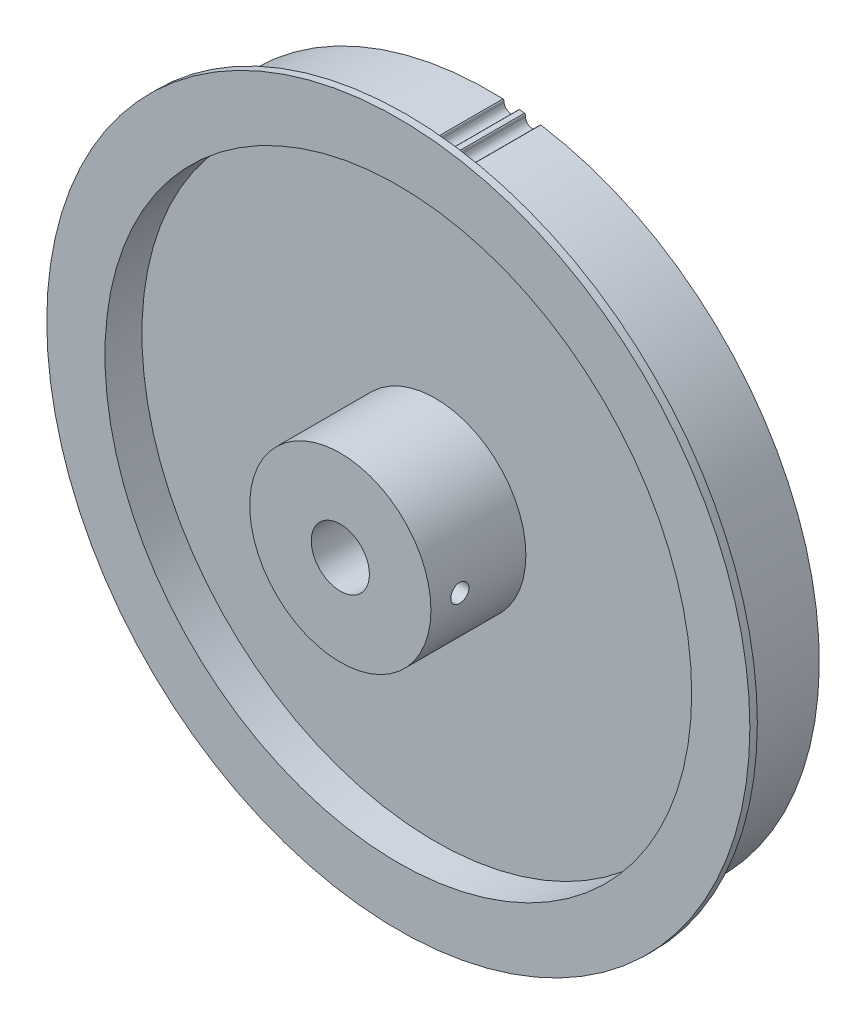
ISO-10303-21;
HEADER;
FILE_DESCRIPTION(('STEP AP214'),'2;1');
FILE_NAME('part.step','',(''),(''),'','','');
FILE_SCHEMA(('AUTOMOTIVE_DESIGN { 1 0 10303 214 1 1 1 1 }'));
ENDSEC;
DATA;
#1=APPLICATION_CONTEXT('core data for automotive mechanical design processes');
#2=APPLICATION_PROTOCOL_DEFINITION('international standard','automotive_design',2000,#1);
#3=PRODUCT_CONTEXT('',#1,'mechanical');
#4=PRODUCT('Part','Part','',(#3));
#5=PRODUCT_RELATED_PRODUCT_CATEGORY('part','',(#4));
#6=PRODUCT_DEFINITION_FORMATION('','',#4);
#7=PRODUCT_DEFINITION_CONTEXT('part definition',#1,'design');
#8=PRODUCT_DEFINITION('design','',#6,#7);
#9=PRODUCT_DEFINITION_SHAPE('','',#8);
#10=(LENGTH_UNIT() NAMED_UNIT(*) SI_UNIT(.MILLI.,.METRE.));
#11=(NAMED_UNIT(*) PLANE_ANGLE_UNIT() SI_UNIT($,.RADIAN.));
#12=(NAMED_UNIT(*) SI_UNIT($,.STERADIAN.) SOLID_ANGLE_UNIT());
#13=UNCERTAINTY_MEASURE_WITH_UNIT(LENGTH_MEASURE(1.E-05),#10,'distance_accuracy_value','');
#14=(GEOMETRIC_REPRESENTATION_CONTEXT(3) GLOBAL_UNCERTAINTY_ASSIGNED_CONTEXT((#13)) GLOBAL_UNIT_ASSIGNED_CONTEXT((#10,
#11,#12)) REPRESENTATION_CONTEXT('',''));
#15=CARTESIAN_POINT('',(0.,0.,0.));
#16=DIRECTION('',(0.,0.,1.));
#17=DIRECTION('',(1.,0.,0.));
#18=AXIS2_PLACEMENT_3D('',#15,#16,#17);
#19=CARTESIAN_POINT('',(-6.468849377307,44.12556718408,5.55));
#20=DIRECTION('',(0.,0.,1.));
#21=DIRECTION('',(1.,0.,0.));
#22=AXIS2_PLACEMENT_3D('',#19,#20,#21);
#23=CYLINDRICAL_SURFACE('',#22,11.43);
#24=DIRECTION('',(0.,0.,1.));
#25=VECTOR('',#24,1.);
#26=CARTESIAN_POINT('',(4.94000741896315,44.82046761019,5.55));
#27=LINE('',#26,#25);
#28=CARTESIAN_POINT('',(4.94000741896301,44.8204676101896,5.55));
#29=VERTEX_POINT('',#28);
#30=CARTESIAN_POINT('',(4.94000741896301,44.8204676101896,-5.5));
#31=VERTEX_POINT('',#30);
#32=EDGE_CURVE('E104',#29,#31,#27,.F.);
#33=ORIENTED_EDGE('',*,*,#32,.T.);
#34=CARTESIAN_POINT('',(-6.468849377307,44.12556718408,-5.5));
#35=DIRECTION('',(0.,0.,1.));
#36=DIRECTION('',(1.,0.,0.));
#37=AXIS2_PLACEMENT_3D('',#34,#35,#36);
#38=CIRCLE('',#37,11.43);
#39=CARTESIAN_POINT('',(4.92698409902675,45.0086749802588,-5.5));
#40=VERTEX_POINT('',#39);
#41=EDGE_CURVE('E109',#31,#40,#38,.T.);
#42=ORIENTED_EDGE('',*,*,#41,.T.);
#43=DIRECTION('',(0.,0.,1.));
#44=VECTOR('',#43,1.);
#45=CARTESIAN_POINT('',(4.92698409902668,45.00867498026,5.55));
#46=LINE('',#45,#44);
#47=CARTESIAN_POINT('',(4.92698409902675,45.0086749802588,5.55));
#48=VERTEX_POINT('',#47);
#49=EDGE_CURVE('E107',#48,#40,#46,.F.);
#50=ORIENTED_EDGE('',*,*,#49,.F.);
#51=CARTESIAN_POINT('',(-6.468849377307,44.12556718408,5.55));
#52=DIRECTION('',(0.,0.,1.));
#53=DIRECTION('',(1.,0.,0.));
#54=AXIS2_PLACEMENT_3D('',#51,#52,#53);
#55=CIRCLE('',#54,11.43);
#56=EDGE_CURVE('E19',#48,#29,#55,.F.);
#57=ORIENTED_EDGE('',*,*,#56,.T.);
#58=EDGE_LOOP('',(#33,#42,#50,#57));
#59=FACE_BOUND('',#58,.T.);
#60=ADVANCED_FACE('F16',(#59),#23,.T.);
#61=CARTESIAN_POINT('',(14.95302336149,42.0156968755,5.55));
#62=DIRECTION('',(0.,0.,1.));
#63=DIRECTION('',(1.,0.,0.));
#64=AXIS2_PLACEMENT_3D('',#61,#62,#63);
#65=CYLINDRICAL_SURFACE('',#64,11.43);
#66=DIRECTION('',(0.,0.,1.));
#67=VECTOR('',#66,1.);
#68=CARTESIAN_POINT('',(3.94844341431126,45.1050528255402,5.55));
#69=LINE('',#68,#67);
#70=CARTESIAN_POINT('',(3.94844341430986,45.1050528255435,-5.5));
#71=VERTEX_POINT('',#70);
#72=CARTESIAN_POINT('',(3.94844341430986,45.1050528255435,5.55));
#73=VERTEX_POINT('',#72);
#74=EDGE_CURVE('E141',#71,#73,#69,.T.);
#75=ORIENTED_EDGE('',*,*,#74,.F.);
#76=CARTESIAN_POINT('',(14.95302336149,42.0156968755,-5.5));
#77=DIRECTION('',(0.,0.,1.));
#78=DIRECTION('',(1.,0.,0.));
#79=AXIS2_PLACEMENT_3D('',#76,#77,#78);
#80=CIRCLE('',#79,11.43);
#81=CARTESIAN_POINT('',(3.89895289738062,44.9230025309883,-5.5));
#82=VERTEX_POINT('',#81);
#83=EDGE_CURVE('E147',#71,#82,#80,.T.);
#84=ORIENTED_EDGE('',*,*,#83,.T.);
#85=DIRECTION('',(0.,0.,1.));
#86=VECTOR('',#85,1.);
#87=CARTESIAN_POINT('',(3.89895289738418,44.9230025309897,5.55));
#88=LINE('',#87,#86);
#89=CARTESIAN_POINT('',(3.89895289738062,44.9230025309883,5.55));
#90=VERTEX_POINT('',#89);
#91=EDGE_CURVE('E117',#82,#90,#88,.T.);
#92=ORIENTED_EDGE('',*,*,#91,.T.);
#93=CARTESIAN_POINT('',(14.95302336149,42.0156968755,5.55));
#94=DIRECTION('',(0.,0.,1.));
#95=DIRECTION('',(1.,0.,0.));
#96=AXIS2_PLACEMENT_3D('',#93,#94,#95);
#97=CIRCLE('',#96,11.43);
#98=EDGE_CURVE('E149',#90,#73,#97,.F.);
#99=ORIENTED_EDGE('',*,*,#98,.T.);
#100=EDGE_LOOP('',(#75,#84,#92,#99));
#101=FACE_BOUND('',#100,.T.);
#102=ADVANCED_FACE('F348',(#101),#65,.T.);
#103=CARTESIAN_POINT('',(-9.340949247126,43.6080079658,5.55));
#104=DIRECTION('',(0.,0.,1.));
#105=DIRECTION('',(1.,0.,0.));
#106=AXIS2_PLACEMENT_3D('',#103,#104,#105);
#107=CYLINDRICAL_SURFACE('',#106,11.43);
#108=DIRECTION('',(0.,0.,1.));
#109=VECTOR('',#108,1.);
#110=CARTESIAN_POINT('',(1.99803164861319,45.04759549217,5.55));
#111=LINE('',#110,#109);
#112=CARTESIAN_POINT('',(1.9980316486129,45.0475954921691,5.55));
#113=VERTEX_POINT('',#112);
#114=CARTESIAN_POINT('',(1.9980316486129,45.0475954921691,-5.5));
#115=VERTEX_POINT('',#114);
#116=EDGE_CURVE('E157',#113,#115,#111,.F.);
#117=ORIENTED_EDGE('',*,*,#116,.T.);
#118=CARTESIAN_POINT('',(-9.340949247126,43.6080079658,-5.5));
#119=DIRECTION('',(0.,0.,1.));
#120=DIRECTION('',(1.,0.,0.));
#121=AXIS2_PLACEMENT_3D('',#118,#119,#120);
#122=CIRCLE('',#121,11.43);
#123=CARTESIAN_POINT('',(1.97272686165669,45.2345481299438,-5.5));
#124=VERTEX_POINT('',#123);
#125=EDGE_CURVE('E145',#115,#124,#122,.T.);
#126=ORIENTED_EDGE('',*,*,#125,.T.);
#127=DIRECTION('',(0.,0.,1.));
#128=VECTOR('',#127,1.);
#129=CARTESIAN_POINT('',(1.9727268616578,45.2345481299401,5.55));
#130=LINE('',#129,#128);
#131=CARTESIAN_POINT('',(1.97272686165669,45.2345481299438,5.55));
#132=VERTEX_POINT('',#131);
#133=EDGE_CURVE('E133',#132,#124,#130,.F.);
#134=ORIENTED_EDGE('',*,*,#133,.F.);
#135=CARTESIAN_POINT('',(-9.340949247126,43.6080079658,5.55));
#136=DIRECTION('',(0.,0.,1.));
#137=DIRECTION('',(1.,0.,0.));
#138=AXIS2_PLACEMENT_3D('',#135,#136,#137);
#139=CIRCLE('',#138,11.43);
#140=EDGE_CURVE('E139',#132,#113,#139,.F.);
#141=ORIENTED_EDGE('',*,*,#140,.T.);
#142=EDGE_LOOP('',(#117,#126,#134,#141));
#143=FACE_BOUND('',#142,.T.);
#144=ADVANCED_FACE('F345',(#143),#107,.T.);
#145=CARTESIAN_POINT('',(17.66896584311,40.94776352401,5.55));
#146=DIRECTION('',(0.,0.,1.));
#147=DIRECTION('',(1.,0.,0.));
#148=AXIS2_PLACEMENT_3D('',#145,#146,#147);
#149=CYLINDRICAL_SURFACE('',#148,11.43);
#150=DIRECTION('',(0.,0.,1.));
#151=VECTOR('',#150,1.);
#152=CARTESIAN_POINT('',(6.89000109275661,44.7502388902298,5.55));
#153=LINE('',#152,#151);
#154=CARTESIAN_POINT('',(6.89000109275763,44.7502388902281,-5.5));
#155=VERTEX_POINT('',#154);
#156=CARTESIAN_POINT('',(6.89000109275763,44.7502388902281,5.55));
#157=VERTEX_POINT('',#156);
#158=EDGE_CURVE('E126',#155,#157,#153,.T.);
#159=ORIENTED_EDGE('',*,*,#158,.F.);
#160=CARTESIAN_POINT('',(17.66896584311,40.94776352401,-5.5));
#161=DIRECTION('',(0.,0.,1.));
#162=DIRECTION('',(1.,0.,0.));
#163=AXIS2_PLACEMENT_3D('',#160,#161,#162);
#164=CIRCLE('',#163,11.43);
#165=CARTESIAN_POINT('',(6.82870987988299,44.5718152140093,-5.5));
#166=VERTEX_POINT('',#165);
#167=EDGE_CURVE('E142',#155,#166,#164,.T.);
#168=ORIENTED_EDGE('',*,*,#167,.T.);
#169=DIRECTION('',(0.,0.,1.));
#170=VECTOR('',#169,1.);
#171=CARTESIAN_POINT('',(6.8287098798803,44.5718152140102,5.55));
#172=LINE('',#171,#170);
#173=CARTESIAN_POINT('',(6.82870987988299,44.5718152140093,5.55));
#174=VERTEX_POINT('',#173);
#175=EDGE_CURVE('E118',#166,#174,#172,.T.);
#176=ORIENTED_EDGE('',*,*,#175,.T.);
#177=CARTESIAN_POINT('',(17.66896584311,40.94776352401,5.55));
#178=DIRECTION('',(0.,0.,1.));
#179=DIRECTION('',(1.,0.,0.));
#180=AXIS2_PLACEMENT_3D('',#177,#178,#179);
#181=CIRCLE('',#180,11.43);
#182=EDGE_CURVE('E121',#174,#157,#181,.F.);
#183=ORIENTED_EDGE('',*,*,#182,.T.);
#184=EDGE_LOOP('',(#159,#168,#176,#183));
#185=FACE_BOUND('',#184,.T.);
#186=ADVANCED_FACE('F342',(#185),#149,.T.);
#187=CARTESIAN_POINT('',(5.908492595891,44.87945693525,5.55));
#188=DIRECTION('',(0.,0.,1.));
#189=DIRECTION('',(1.,0.,0.));
#190=AXIS2_PLACEMENT_3D('',#187,#188,#189);
#191=CYLINDRICAL_SURFACE('',#190,0.97028);
#192=CARTESIAN_POINT('',(5.908492595891,44.87945693525,5.55));
#193=DIRECTION('',(0.,0.,1.));
#194=DIRECTION('',(1.,0.,0.));
#195=AXIS2_PLACEMENT_3D('',#192,#193,#194);
#196=CIRCLE('',#195,0.97028);
#197=EDGE_CURVE('E114',#29,#174,#196,.T.);
#198=ORIENTED_EDGE('',*,*,#197,.T.);
#199=ORIENTED_EDGE('',*,*,#175,.F.);
#200=CARTESIAN_POINT('',(5.908492595891,44.87945693525,-5.5));
#201=DIRECTION('',(0.,0.,1.));
#202=DIRECTION('',(1.,0.,0.));
#203=AXIS2_PLACEMENT_3D('',#200,#201,#202);
#204=CIRCLE('',#203,0.97028);
#205=EDGE_CURVE('E116',#166,#31,#204,.F.);
#206=ORIENTED_EDGE('',*,*,#205,.T.);
#207=ORIENTED_EDGE('',*,*,#32,.F.);
#208=EDGE_LOOP('',(#198,#199,#206,#207));
#209=FACE_BOUND('',#208,.T.);
#210=ADVANCED_FACE('F112',(#209),#191,.F.);
#211=CARTESIAN_POINT('',(2.960585137985,45.16980047774,5.55));
#212=DIRECTION('',(0.,0.,1.));
#213=DIRECTION('',(1.,0.,0.));
#214=AXIS2_PLACEMENT_3D('',#211,#212,#213);
#215=CYLINDRICAL_SURFACE('',#214,0.97028);
#216=CARTESIAN_POINT('',(2.960585137985,45.16980047774,5.55));
#217=DIRECTION('',(0.,0.,1.));
#218=DIRECTION('',(1.,0.,0.));
#219=AXIS2_PLACEMENT_3D('',#216,#217,#218);
#220=CIRCLE('',#219,0.97028);
#221=EDGE_CURVE('E136',#113,#90,#220,.T.);
#222=ORIENTED_EDGE('',*,*,#221,.T.);
#223=ORIENTED_EDGE('',*,*,#91,.F.);
#224=CARTESIAN_POINT('',(2.960585137985,45.16980047774,-5.5));
#225=DIRECTION('',(0.,0.,1.));
#226=DIRECTION('',(1.,0.,0.));
#227=AXIS2_PLACEMENT_3D('',#224,#225,#226);
#228=CIRCLE('',#227,0.97028);
#229=EDGE_CURVE('E168',#82,#115,#228,.F.);
#230=ORIENTED_EDGE('',*,*,#229,.T.);
#231=ORIENTED_EDGE('',*,*,#116,.F.);
#232=EDGE_LOOP('',(#222,#223,#230,#231));
#233=FACE_BOUND('',#232,.T.);
#234=ADVANCED_FACE('F335',(#233),#215,.F.);
#235=CARTESIAN_POINT('',(0.,0.,-6.13));
#236=DIRECTION('',(0.,0.,1.));
#237=DIRECTION('',(1.,0.,0.));
#238=AXIS2_PLACEMENT_3D('',#235,#236,#237);
#239=CYLINDRICAL_SURFACE('',#238,40.475);
#240=CARTESIAN_POINT('',(0.,0.,-2.));
#241=DIRECTION('',(0.,0.,1.));
#242=DIRECTION('',(1.,0.,0.));
#243=AXIS2_PLACEMENT_3D('',#240,#241,#242);
#244=CIRCLE('',#243,40.475);
#245=CARTESIAN_POINT('',(40.475,0.,-2.));
#246=VERTEX_POINT('',#245);
#247=EDGE_CURVE('E182',#246,#246,#244,.T.);
#248=ORIENTED_EDGE('',*,*,#247,.T.);
#249=EDGE_LOOP('',(#248));
#250=FACE_BOUND('',#249,.T.);
#251=CARTESIAN_POINT('',(0.,0.,-5.5));
#252=DIRECTION('',(0.,0.,1.));
#253=DIRECTION('',(1.,0.,0.));
#254=AXIS2_PLACEMENT_3D('',#251,#252,#253);
#255=CIRCLE('',#254,40.475);
#256=CARTESIAN_POINT('',(40.475,0.,-5.5));
#257=VERTEX_POINT('',#256);
#258=EDGE_CURVE('E179',#257,#257,#255,.F.);
#259=ORIENTED_EDGE('',*,*,#258,.T.);
#260=EDGE_LOOP('',(#259));
#261=FACE_BOUND('',#260,.T.);
#262=ADVANCED_FACE('F332',(#250,#261),#239,.F.);
#263=CARTESIAN_POINT('',(4.628160021203,44.98551793138,5.55));
#264=DIRECTION('',(0.,0.,1.));
#265=DIRECTION('',(1.,0.,0.));
#266=AXIS2_PLACEMENT_3D('',#263,#264,#265);
#267=CYLINDRICAL_SURFACE('',#266,0.29972);
#268=ORIENTED_EDGE('',*,*,#49,.T.);
#269=CARTESIAN_POINT('',(4.628160021203,44.98551793138,-5.5));
#270=DIRECTION('',(0.,0.,1.));
#271=DIRECTION('',(1.,0.,0.));
#272=AXIS2_PLACEMENT_3D('',#269,#270,#271);
#273=CIRCLE('',#272,0.29972);
#274=CARTESIAN_POINT('',(4.81572773553458,45.219292247637,-5.5));
#275=VERTEX_POINT('',#274);
#276=EDGE_CURVE('E155',#40,#275,#273,.T.);
#277=ORIENTED_EDGE('',*,*,#276,.T.);
#278=DIRECTION('',(0.,0.,1.));
#279=VECTOR('',#278,1.);
#280=CARTESIAN_POINT('',(4.81572773553765,45.2192922476367,-6.53));
#281=LINE('',#280,#279);
#282=CARTESIAN_POINT('',(4.81572773553458,45.219292247637,5.55));
#283=VERTEX_POINT('',#282);
#284=EDGE_CURVE('E185',#283,#275,#281,.F.);
#285=ORIENTED_EDGE('',*,*,#284,.F.);
#286=CARTESIAN_POINT('',(4.628160021203,44.98551793138,5.55));
#287=DIRECTION('',(0.,0.,1.));
#288=DIRECTION('',(1.,0.,0.));
#289=AXIS2_PLACEMENT_3D('',#286,#287,#288);
#290=CIRCLE('',#289,0.29972);
#291=EDGE_CURVE('E123',#283,#48,#290,.F.);
#292=ORIENTED_EDGE('',*,*,#291,.T.);
#293=EDGE_LOOP('',(#268,#277,#285,#292));
#294=FACE_BOUND('',#293,.T.);
#295=ADVANCED_FACE('F154',(#294),#267,.T.);
#296=CARTESIAN_POINT('',(4.23700795515,45.0240430473,5.55));
#297=DIRECTION('',(0.,0.,1.));
#298=DIRECTION('',(1.,0.,0.));
#299=AXIS2_PLACEMENT_3D('',#296,#297,#298);
#300=CYLINDRICAL_SURFACE('',#299,0.29972);
#301=DIRECTION('',(0.,0.,1.));
#302=VECTOR('',#301,1.);
#303=CARTESIAN_POINT('',(4.09865140848718,45.2899181014021,-6.53));
#304=LINE('',#303,#302);
#305=CARTESIAN_POINT('',(4.09865140848447,45.2899181014023,-5.5));
#306=VERTEX_POINT('',#305);
#307=CARTESIAN_POINT('',(4.09865140848447,45.2899181014023,5.55));
#308=VERTEX_POINT('',#307);
#309=EDGE_CURVE('E187',#306,#308,#304,.T.);
#310=ORIENTED_EDGE('',*,*,#309,.F.);
#311=CARTESIAN_POINT('',(4.23700795515,45.0240430473,-5.5));
#312=DIRECTION('',(0.,0.,1.));
#313=DIRECTION('',(1.,0.,0.));
#314=AXIS2_PLACEMENT_3D('',#311,#312,#313);
#315=CIRCLE('',#314,0.29972);
#316=EDGE_CURVE('E165',#306,#71,#315,.T.);
#317=ORIENTED_EDGE('',*,*,#316,.T.);
#318=ORIENTED_EDGE('',*,*,#74,.T.);
#319=CARTESIAN_POINT('',(4.23700795515,45.0240430473,5.55));
#320=DIRECTION('',(0.,0.,1.));
#321=DIRECTION('',(1.,0.,0.));
#322=AXIS2_PLACEMENT_3D('',#319,#320,#321);
#323=CIRCLE('',#322,0.29972);
#324=EDGE_CURVE('E134',#73,#308,#323,.F.);
#325=ORIENTED_EDGE('',*,*,#324,.T.);
#326=EDGE_LOOP('',(#310,#317,#318,#325));
#327=FACE_BOUND('',#326,.T.);
#328=ADVANCED_FACE('F325',(#327),#300,.T.);
#329=CARTESIAN_POINT('',(0.,0.,5.55));
#330=DIRECTION('',(0.,0.,1.));
#331=DIRECTION('',(1.,0.,0.));
#332=AXIS2_PLACEMENT_3D('',#329,#330,#331);
#333=PLANE('',#332);
#334=ORIENTED_EDGE('',*,*,#98,.F.);
#335=ORIENTED_EDGE('',*,*,#221,.F.);
#336=ORIENTED_EDGE('',*,*,#140,.F.);
#337=CARTESIAN_POINT('',(1.676057132582,45.19189663231,5.55));
#338=DIRECTION('',(0.,0.,1.));
#339=DIRECTION('',(1.,0.,0.));
#340=AXIS2_PLACEMENT_3D('',#337,#338,#339);
#341=CIRCLE('',#340,0.29972);
#342=CARTESIAN_POINT('',(1.84793367822906,45.4374379352629,5.55));
#343=VERTEX_POINT('',#342);
#344=EDGE_CURVE('E130',#343,#132,#341,.F.);
#345=ORIENTED_EDGE('',*,*,#344,.F.);
#346=CARTESIAN_POINT('',(0.,0.,5.55));
#347=DIRECTION('',(0.,0.,1.));
#348=DIRECTION('',(1.,0.,0.));
#349=AXIS2_PLACEMENT_3D('',#346,#347,#348);
#350=CIRCLE('',#349,45.475);
#351=EDGE_CURVE('E188',#308,#343,#350,.T.);
#352=ORIENTED_EDGE('',*,*,#351,.F.);
#353=ORIENTED_EDGE('',*,*,#324,.F.);
#354=EDGE_LOOP('',(#334,#335,#336,#345,#352,#353));
#355=FACE_BOUND('',#354,.T.);
#356=ADVANCED_FACE('F321',(#355),#333,.F.);
#357=CARTESIAN_POINT('',(1.676057132582,45.19189663231,5.55));
#358=DIRECTION('',(0.,0.,1.));
#359=DIRECTION('',(1.,0.,0.));
#360=AXIS2_PLACEMENT_3D('',#357,#358,#359);
#361=CYLINDRICAL_SURFACE('',#360,0.29972);
#362=ORIENTED_EDGE('',*,*,#133,.T.);
#363=CARTESIAN_POINT('',(1.676057132582,45.19189663231,-5.5));
#364=DIRECTION('',(0.,0.,1.));
#365=DIRECTION('',(1.,0.,0.));
#366=AXIS2_PLACEMENT_3D('',#363,#364,#365);
#367=CIRCLE('',#366,0.29972);
#368=CARTESIAN_POINT('',(1.84793367822906,45.4374379352629,-5.5));
#369=VERTEX_POINT('',#368);
#370=EDGE_CURVE('E173',#124,#369,#367,.T.);
#371=ORIENTED_EDGE('',*,*,#370,.T.);
#372=DIRECTION('',(0.,0.,1.));
#373=VECTOR('',#372,1.);
#374=CARTESIAN_POINT('',(1.84793367822712,45.437437935263,-6.53));
#375=LINE('',#374,#373);
#376=EDGE_CURVE('E191',#343,#369,#375,.F.);
#377=ORIENTED_EDGE('',*,*,#376,.F.);
#378=ORIENTED_EDGE('',*,*,#344,.T.);
#379=EDGE_LOOP('',(#362,#371,#377,#378));
#380=FACE_BOUND('',#379,.T.);
#381=ADVANCED_FACE('F318',(#380),#361,.T.);
#382=CARTESIAN_POINT('',(7.172649501765,44.65052953618,5.55));
#383=DIRECTION('',(0.,0.,1.));
#384=DIRECTION('',(1.,0.,0.));
#385=AXIS2_PLACEMENT_3D('',#382,#383,#384);
#386=CYLINDRICAL_SURFACE('',#385,0.29972);
#387=DIRECTION('',(0.,0.,1.));
#388=VECTOR('',#387,1.);
#389=CARTESIAN_POINT('',(7.05197824761216,44.924884282491,-6.53));
#390=LINE('',#389,#388);
#391=CARTESIAN_POINT('',(7.05197824761548,44.9248842824905,-5.5));
#392=VERTEX_POINT('',#391);
#393=CARTESIAN_POINT('',(7.05197824761548,44.9248842824905,5.55));
#394=VERTEX_POINT('',#393);
#395=EDGE_CURVE('E196',#392,#394,#390,.T.);
#396=ORIENTED_EDGE('',*,*,#395,.F.);
#397=CARTESIAN_POINT('',(7.172649501765,44.65052953618,-5.5));
#398=DIRECTION('',(0.,0.,1.));
#399=DIRECTION('',(1.,0.,0.));
#400=AXIS2_PLACEMENT_3D('',#397,#398,#399);
#401=CIRCLE('',#400,0.29972);
#402=EDGE_CURVE('E176',#392,#155,#401,.T.);
#403=ORIENTED_EDGE('',*,*,#402,.T.);
#404=ORIENTED_EDGE('',*,*,#158,.T.);
#405=CARTESIAN_POINT('',(7.172649501765,44.65052953618,5.55));
#406=DIRECTION('',(0.,0.,1.));
#407=DIRECTION('',(1.,0.,0.));
#408=AXIS2_PLACEMENT_3D('',#405,#406,#407);
#409=CIRCLE('',#408,0.29972);
#410=EDGE_CURVE('E34',#157,#394,#409,.F.);
#411=ORIENTED_EDGE('',*,*,#410,.T.);
#412=EDGE_LOOP('',(#396,#403,#404,#411));
#413=FACE_BOUND('',#412,.T.);
#414=ADVANCED_FACE('F315',(#413),#386,.T.);
#415=CARTESIAN_POINT('',(0.,0.,5.55));
#416=DIRECTION('',(0.,0.,1.));
#417=DIRECTION('',(1.,0.,0.));
#418=AXIS2_PLACEMENT_3D('',#415,#416,#417);
#419=PLANE('',#418);
#420=ORIENTED_EDGE('',*,*,#182,.F.);
#421=ORIENTED_EDGE('',*,*,#197,.F.);
#422=ORIENTED_EDGE('',*,*,#56,.F.);
#423=ORIENTED_EDGE('',*,*,#291,.F.);
#424=CARTESIAN_POINT('',(0.,0.,5.55));
#425=DIRECTION('',(0.,0.,1.));
#426=DIRECTION('',(1.,0.,0.));
#427=AXIS2_PLACEMENT_3D('',#424,#425,#426);
#428=CIRCLE('',#427,45.475);
#429=EDGE_CURVE('E192',#394,#283,#428,.T.);
#430=ORIENTED_EDGE('',*,*,#429,.F.);
#431=ORIENTED_EDGE('',*,*,#410,.F.);
#432=EDGE_LOOP('',(#420,#421,#422,#423,#430,#431));
#433=FACE_BOUND('',#432,.T.);
#434=ADVANCED_FACE('F120',(#433),#419,.F.);
#435=CARTESIAN_POINT('',(0.,0.,-5.5));
#436=DIRECTION('',(0.,0.,1.));
#437=DIRECTION('',(1.,0.,0.));
#438=AXIS2_PLACEMENT_3D('',#435,#436,#437);
#439=PLANE('',#438);
#440=ORIENTED_EDGE('',*,*,#258,.F.);
#441=EDGE_LOOP('',(#440));
#442=FACE_BOUND('',#441,.T.);
#443=ORIENTED_EDGE('',*,*,#402,.F.);
#444=CARTESIAN_POINT('',(0.,0.,-5.5));
#445=DIRECTION('',(0.,0.,1.));
#446=DIRECTION('',(1.,0.,0.));
#447=AXIS2_PLACEMENT_3D('',#444,#445,#446);
#448=CIRCLE('',#447,45.475);
#449=EDGE_CURVE('E195',#369,#392,#448,.T.);
#450=ORIENTED_EDGE('',*,*,#449,.F.);
#451=ORIENTED_EDGE('',*,*,#370,.F.);
#452=ORIENTED_EDGE('',*,*,#125,.F.);
#453=ORIENTED_EDGE('',*,*,#229,.F.);
#454=ORIENTED_EDGE('',*,*,#83,.F.);
#455=ORIENTED_EDGE('',*,*,#316,.F.);
#456=CARTESIAN_POINT('',(0.,0.,-5.5));
#457=DIRECTION('',(0.,0.,1.));
#458=DIRECTION('',(1.,0.,0.));
#459=AXIS2_PLACEMENT_3D('',#456,#457,#458);
#460=CIRCLE('',#459,45.475);
#461=EDGE_CURVE('E163',#275,#306,#460,.T.);
#462=ORIENTED_EDGE('',*,*,#461,.F.);
#463=ORIENTED_EDGE('',*,*,#276,.F.);
#464=ORIENTED_EDGE('',*,*,#41,.F.);
#465=ORIENTED_EDGE('',*,*,#205,.F.);
#466=ORIENTED_EDGE('',*,*,#167,.F.);
#467=EDGE_LOOP('',(#443,#450,#451,#452,#453,#454,#455,#462,#463,#464,#465,#466));
#468=FACE_BOUND('',#467,.T.);
#469=ADVANCED_FACE('F160',(#442,#468),#439,.F.);
#470=CARTESIAN_POINT('',(0.,0.,-2.));
#471=DIRECTION('',(0.,0.,1.));
#472=DIRECTION('',(1.,0.,0.));
#473=AXIS2_PLACEMENT_3D('',#470,#471,#472);
#474=PLANE('',#473);
#475=CARTESIAN_POINT('',(0.,0.,-2.));
#476=DIRECTION('',(0.,0.,1.));
#477=DIRECTION('',(1.,0.,0.));
#478=AXIS2_PLACEMENT_3D('',#475,#476,#477);
#479=CIRCLE('',#478,12.5);
#480=CARTESIAN_POINT('',(12.5,0.,-2.));
#481=VERTEX_POINT('',#480);
#482=EDGE_CURVE('E198',#481,#481,#479,.F.);
#483=ORIENTED_EDGE('',*,*,#482,.F.);
#484=EDGE_LOOP('',(#483));
#485=FACE_BOUND('',#484,.T.);
#486=ORIENTED_EDGE('',*,*,#247,.F.);
#487=EDGE_LOOP('',(#486));
#488=FACE_BOUND('',#487,.T.);
#489=ADVANCED_FACE('F305',(#485,#488),#474,.F.);
#490=CARTESIAN_POINT('',(0.,0.,-6.53));
#491=DIRECTION('',(0.,0.,1.));
#492=DIRECTION('',(1.,0.,0.));
#493=AXIS2_PLACEMENT_3D('',#490,#491,#492);
#494=CYLINDRICAL_SURFACE('',#493,45.475);
#495=ORIENTED_EDGE('',*,*,#376,.T.);
#496=ORIENTED_EDGE('',*,*,#449,.T.);
#497=ORIENTED_EDGE('',*,*,#395,.T.);
#498=ORIENTED_EDGE('',*,*,#429,.T.);
#499=ORIENTED_EDGE('',*,*,#284,.T.);
#500=ORIENTED_EDGE('',*,*,#461,.T.);
#501=ORIENTED_EDGE('',*,*,#309,.T.);
#502=ORIENTED_EDGE('',*,*,#351,.T.);
#503=EDGE_LOOP('',(#495,#496,#497,#498,#499,#500,#501,#502));
#504=FACE_BOUND('',#503,.T.);
#505=CARTESIAN_POINT('',(0.,0.,5.6));
#506=DIRECTION('',(0.,0.,1.));
#507=DIRECTION('',(0.,1.,0.));
#508=AXIS2_PLACEMENT_3D('',#505,#506,#507);
#509=CIRCLE('',#508,45.475);
#510=CARTESIAN_POINT('',(0.,45.475,5.6));
#511=VERTEX_POINT('',#510);
#512=EDGE_CURVE('E201',#511,#511,#509,.T.);
#513=ORIENTED_EDGE('',*,*,#512,.F.);
#514=EDGE_LOOP('',(#513));
#515=FACE_BOUND('',#514,.T.);
#516=ADVANCED_FACE('F301',(#504,#515),#494,.T.);
#517=CARTESIAN_POINT('',(0.,0.,-6.13));
#518=DIRECTION('',(0.,0.,1.));
#519=DIRECTION('',(1.,0.,0.));
#520=AXIS2_PLACEMENT_3D('',#517,#518,#519);
#521=CYLINDRICAL_SURFACE('',#520,12.5);
#522=ORIENTED_EDGE('',*,*,#482,.T.);
#523=EDGE_LOOP('',(#522));
#524=FACE_BOUND('',#523,.T.);
#525=CARTESIAN_POINT('',(0.,0.,-5.5));
#526=DIRECTION('',(0.,0.,1.));
#527=DIRECTION('',(1.,0.,0.));
#528=AXIS2_PLACEMENT_3D('',#525,#526,#527);
#529=CIRCLE('',#528,12.5);
#530=CARTESIAN_POINT('',(12.5,0.,-5.5));
#531=VERTEX_POINT('',#530);
#532=EDGE_CURVE('E202',#531,#531,#529,.T.);
#533=ORIENTED_EDGE('',*,*,#532,.T.);
#534=EDGE_LOOP('',(#533));
#535=FACE_BOUND('',#534,.T.);
#536=ADVANCED_FACE('F297',(#524,#535),#521,.T.);
#537=CARTESIAN_POINT('',(0.,0.,15.6));
#538=DIRECTION('',(0.,0.,1.));
#539=DIRECTION('',(0.,1.,0.));
#540=AXIS2_PLACEMENT_3D('',#537,#538,#539);
#541=TOROIDAL_SURFACE('',#540,45.475,10.);
#542=ORIENTED_EDGE('',*,*,#512,.T.);
#543=EDGE_LOOP('',(#542));
#544=FACE_BOUND('',#543,.T.);
#545=CARTESIAN_POINT('',(0.,0.,6.06850615066));
#546=DIRECTION('',(0.,0.,1.));
#547=DIRECTION('',(1.,0.,0.));
#548=AXIS2_PLACEMENT_3D('',#545,#546,#547);
#549=CIRCLE('',#548,48.5);
#550=CARTESIAN_POINT('',(48.5,0.,6.06850615066));
#551=VERTEX_POINT('',#550);
#552=EDGE_CURVE('E205',#551,#551,#549,.T.);
#553=ORIENTED_EDGE('',*,*,#552,.F.);
#554=EDGE_LOOP('',(#553));
#555=FACE_BOUND('',#554,.T.);
#556=ADVANCED_FACE('F292',(#544,#555),#541,.T.);
#557=CARTESIAN_POINT('',(0.,0.,-5.5));
#558=DIRECTION('',(0.,0.,1.));
#559=DIRECTION('',(1.,0.,0.));
#560=AXIS2_PLACEMENT_3D('',#557,#558,#559);
#561=PLANE('',#560);
#562=CARTESIAN_POINT('',(0.,0.,-5.5));
#563=DIRECTION('',(0.,0.,1.));
#564=DIRECTION('',(1.,0.,0.));
#565=AXIS2_PLACEMENT_3D('',#562,#563,#564);
#566=CIRCLE('',#565,4.009);
#567=CARTESIAN_POINT('',(4.009,0.,-5.5));
#568=VERTEX_POINT('',#567);
#569=EDGE_CURVE('E206',#568,#568,#566,.T.);
#570=ORIENTED_EDGE('',*,*,#569,.T.);
#571=EDGE_LOOP('',(#570));
#572=FACE_BOUND('',#571,.T.);
#573=ORIENTED_EDGE('',*,*,#532,.F.);
#574=EDGE_LOOP('',(#573));
#575=FACE_BOUND('',#574,.T.);
#576=ADVANCED_FACE('F296',(#572,#575),#561,.F.);
#577=CARTESIAN_POINT('',(0.,0.,-6.53));
#578=DIRECTION('',(0.,0.,1.));
#579=DIRECTION('',(1.,0.,0.));
#580=AXIS2_PLACEMENT_3D('',#577,#578,#579);
#581=CYLINDRICAL_SURFACE('',#580,48.5);
#582=CARTESIAN_POINT('',(0.,0.,7.1));
#583=DIRECTION('',(0.,0.,1.));
#584=DIRECTION('',(1.,0.,0.));
#585=AXIS2_PLACEMENT_3D('',#582,#583,#584);
#586=CIRCLE('',#585,48.5);
#587=CARTESIAN_POINT('',(48.5,0.,7.1));
#588=VERTEX_POINT('',#587);
#589=EDGE_CURVE('E209',#588,#588,#586,.T.);
#590=ORIENTED_EDGE('',*,*,#589,.F.);
#591=EDGE_LOOP('',(#590));
#592=FACE_BOUND('',#591,.T.);
#593=ORIENTED_EDGE('',*,*,#552,.T.);
#594=EDGE_LOOP('',(#593));
#595=FACE_BOUND('',#594,.T.);
#596=ADVANCED_FACE('F374',(#592,#595),#581,.T.);
#597=CARTESIAN_POINT('',(0.,0.,-6.53));
#598=DIRECTION('',(0.,0.,1.));
#599=DIRECTION('',(1.,0.,0.));
#600=AXIS2_PLACEMENT_3D('',#597,#598,#599);
#601=CYLINDRICAL_SURFACE('',#600,4.009);
#602=CARTESIAN_POINT('',(0.,0.,15.1));
#603=DIRECTION('',(0.,0.,1.));
#604=DIRECTION('',(1.,0.,0.));
#605=AXIS2_PLACEMENT_3D('',#602,#603,#604);
#606=CIRCLE('',#605,4.009);
#607=CARTESIAN_POINT('',(4.009,0.,15.1));
#608=VERTEX_POINT('',#607);
#609=EDGE_CURVE('E219',#608,#608,#606,.F.);
#610=ORIENTED_EDGE('',*,*,#609,.F.);
#611=EDGE_LOOP('',(#610));
#612=FACE_BOUND('',#611,.T.);
#613=CARTESIAN_POINT('',(4.009,0.,12.35));
#614=CARTESIAN_POINT('',(4.0089974368634,-0.068355932622904,12.3499962380466));
#615=CARTESIAN_POINT('',(4.00723263102806,-0.136785150838388,12.344367154343));
#616=CARTESIAN_POINT('',(4.00035467648122,-0.271711571772511,12.3220331517204));
#617=CARTESIAN_POINT('',(3.99523574205764,-0.338205228366197,12.3053090938764));
#618=CARTESIAN_POINT('',(3.98221117732836,-0.467191981683302,12.2614049492542));
#619=CARTESIAN_POINT('',(3.9743115061162,-0.529693298198447,12.2342472104696));
#620=CARTESIAN_POINT('',(3.9565432869104,-0.649232590151506,12.1703238927068));
#621=CARTESIAN_POINT('',(3.94667505067927,-0.706271428570107,12.1335598348003));
#622=CARTESIAN_POINT('',(3.92567487403081,-0.815054680042847,12.0502673724867));
#623=CARTESIAN_POINT('',(3.91451539128858,-0.866607376767592,12.0034955223991));
#624=CARTESIAN_POINT('',(3.89234993000501,-0.961281530776865,11.9020314174018));
#625=CARTESIAN_POINT('',(3.88134398876351,-1.00440097138641,11.8473372734348));
#626=CARTESIAN_POINT('',(3.86043871659106,-1.08201359144935,11.7299343381081));
#627=CARTESIAN_POINT('',(3.85057320610034,-1.11626887852669,11.6670616872409));
#628=CARTESIAN_POINT('',(3.83347776984426,-1.17364042153194,11.5360910425726));
#629=CARTESIAN_POINT('',(3.82624713841624,-1.1967596604059,11.4679944537482));
#630=CARTESIAN_POINT('',(3.81552677106304,-1.23050538806016,11.3306615793345));
#631=CARTESIAN_POINT('',(3.81193134008748,-1.24148577060525,11.2615207332705));
#632=CARTESIAN_POINT('',(3.80857461840347,-1.25174765913707,11.1222918513226));
#633=CARTESIAN_POINT('',(3.80881231544871,-1.25103225372803,11.0522040703885));
#634=CARTESIAN_POINT('',(3.81300166566478,-1.23819977015971,10.9159959233526));
#635=CARTESIAN_POINT('',(3.81680686814165,-1.22653226668184,10.8498279394654));
#636=CARTESIAN_POINT('',(3.82746465363658,-1.19285544717542,10.7204395059195));
#637=CARTESIAN_POINT('',(3.83431757496487,-1.17084498301728,10.6572193843477));
#638=CARTESIAN_POINT('',(3.85041135817437,-1.11678813045003,10.5344474777859));
#639=CARTESIAN_POINT('',(3.8596855879762,-1.0846000606062,10.4749626377039));
#640=CARTESIAN_POINT('',(3.87956099767499,-1.0112020023676,10.3620943283737));
#641=CARTESIAN_POINT('',(3.89016244497483,-0.969990194646787,10.3087120928138));
#642=CARTESIAN_POINT('',(3.91208439895099,-0.877514121383679,10.2070263667328));
#643=CARTESIAN_POINT('',(3.9234157601037,-0.825880004796789,10.1590609926994));
#644=CARTESIAN_POINT('',(3.94510294854766,-0.715138271588754,10.072370321281));
#645=CARTESIAN_POINT('',(3.95545835329596,-0.656027443609404,10.0336490151183));
#646=CARTESIAN_POINT('',(3.9741364933875,-0.531343528258186,9.96631676848311));
#647=CARTESIAN_POINT('',(3.98244133538057,-0.465720110174248,9.93779391759721));
#648=CARTESIAN_POINT('',(3.99594065065148,-0.330360907637892,9.89234214552963));
#649=CARTESIAN_POINT('',(4.0011415200908,-0.260633907401556,9.87538937218822));
#650=CARTESIAN_POINT('',(4.00598756459767,-0.158565294210583,9.85968906256867));
#651=CARTESIAN_POINT('',(4.00711401642635,-0.126977123063734,9.85605988134675));
#652=CARTESIAN_POINT('',(4.00862083144752,-0.063597924139562,9.85121447161865));
#653=CARTESIAN_POINT('',(4.00900119266048,-0.0318068958242385,9.84999824951457));
#654=CARTESIAN_POINT('',(4.00899743686343,0.0683559326228918,9.85000376195336));
#655=CARTESIAN_POINT('',(4.00723263102807,0.136785150838373,9.85563284565702));
#656=CARTESIAN_POINT('',(4.00035467648121,0.271711571772501,9.8779668482796));
#657=CARTESIAN_POINT('',(3.99523574205763,0.338205228366192,9.89469090612356));
#658=CARTESIAN_POINT('',(3.98221117732836,0.467191981683304,9.93859505074583));
#659=CARTESIAN_POINT('',(3.9743115061162,0.52969329819845,9.9657527895304));
#660=CARTESIAN_POINT('',(3.9565432869104,0.649232590151508,10.0296761072932));
#661=CARTESIAN_POINT('',(3.94667505067927,0.706271428570108,10.0664401651997));
#662=CARTESIAN_POINT('',(3.92567487403081,0.815054680042846,10.1497326275133));
#663=CARTESIAN_POINT('',(3.91451539128858,0.866607376767591,10.1965044776009));
#664=CARTESIAN_POINT('',(3.89234993000501,0.961281530776864,10.2979685825982));
#665=CARTESIAN_POINT('',(3.88134398876351,1.00440097138641,10.3526627265652));
#666=CARTESIAN_POINT('',(3.86043871659106,1.08201359144935,10.4700656618919));
#667=CARTESIAN_POINT('',(3.85057320610034,1.11626887852669,10.5329383127591));
#668=CARTESIAN_POINT('',(3.83347776984426,1.17364042153194,10.6639089574274));
#669=CARTESIAN_POINT('',(3.82624713841624,1.1967596604059,10.7320055462518));
#670=CARTESIAN_POINT('',(3.81552677106304,1.23050538806016,10.8693384206655));
#671=CARTESIAN_POINT('',(3.81193134008748,1.24148577060525,10.9384792667295));
#672=CARTESIAN_POINT('',(3.80857461840347,1.25174765913707,11.0777081486774));
#673=CARTESIAN_POINT('',(3.80881231544871,1.25103225372803,11.1477959296115));
#674=CARTESIAN_POINT('',(3.81300166566478,1.23819977015971,11.2840040766474));
#675=CARTESIAN_POINT('',(3.81680686814165,1.22653226668184,11.3501720605346));
#676=CARTESIAN_POINT('',(3.82746465363658,1.19285544717542,11.4795604940805));
#677=CARTESIAN_POINT('',(3.83431757496487,1.17084498301728,11.5427806156523));
#678=CARTESIAN_POINT('',(3.85041135817437,1.11678813045003,11.6655525222141));
#679=CARTESIAN_POINT('',(3.8596855879762,1.0846000606062,11.7250373622961));
#680=CARTESIAN_POINT('',(3.87956099767499,1.0112020023676,11.8379056716263));
#681=CARTESIAN_POINT('',(3.89016244497483,0.969990194646788,11.8912879071862));
#682=CARTESIAN_POINT('',(3.91208439895099,0.877514121383681,11.9929736332672));
#683=CARTESIAN_POINT('',(3.9234157601037,0.825880004796791,12.0409390073006));
#684=CARTESIAN_POINT('',(3.94510294854766,0.715138271588756,12.127629678719));
#685=CARTESIAN_POINT('',(3.95545835329596,0.656027443609405,12.1663509848817));
#686=CARTESIAN_POINT('',(3.9741364933875,0.531343528258185,12.2336832315169));
#687=CARTESIAN_POINT('',(3.98244133538057,0.465720110174245,12.2622060824028));
#688=CARTESIAN_POINT('',(3.99594065065148,0.330360907637888,12.3076578544704));
#689=CARTESIAN_POINT('',(4.00114152009079,0.260633907401554,12.3246106278118));
#690=CARTESIAN_POINT('',(4.00598756459767,0.158565294210582,12.3403109374313));
#691=CARTESIAN_POINT('',(4.00711401642635,0.126977123063733,12.3439401186533));
#692=CARTESIAN_POINT('',(4.00862083144752,0.0635979241395573,12.3487855283813));
#693=CARTESIAN_POINT('',(4.00900119266047,0.031806895824231,12.3500017504854));
#694=CARTESIAN_POINT('',(4.009,0.,12.35));
#695=B_SPLINE_CURVE_WITH_KNOTS('',3,(#613,#614,#615,#616,#617,#618,#619,#620,#621,#622,#623,
#624,#625,#626,#627,#628,#629,#630,#631,#632,#633,#634,#635,#636,#637,#638,#639,#640,#641,#642,
#643,#644,#645,#646,#647,#648,#649,#650,#651,#652,#653,#654,#655,#656,#657,#658,#659,#660,#661,
#662,#663,#664,#665,#666,#667,#668,#669,#670,#671,#672,#673,#674,#675,#676,#677,#678,#679,#680,
#681,#682,#683,#684,#685,#686,#687,#688,#689,#690,#691,#692,#693,#694),.UNSPECIFIED.,.T.,.F.,(4,
2,2,2,2,2,2,2,2,2,2,2,2,2,2,2,2,2,2,2,2,2,2,2,2,2,2,2,2,2,2,2,2,2,2,2,2,2,2,2,4),(0.,
0.204945289330686,0.410245033496454,0.615107474059521,0.819937496188106,1.03047266250034,
1.24105811345388,1.45681597489054,1.6725160103867,1.88174662624451,2.09092198972208,
2.29186975102363,2.49283982398223,2.69674082284143,2.90068296923193,3.11383290288633,
3.32707470046943,3.54211625569735,3.75671314444085,3.85207657409309,3.94744025676521,
4.1523855460959,4.35768529026168,4.56254773082475,4.76737775295333,4.97791291926557,
5.1884983702191,5.40425623165576,5.61995626715192,5.82918688300974,6.0383622464873,
6.23931000778886,6.44028008074745,6.64418107960666,6.84812322599715,7.06127315965155,
7.27451495723466,7.48955651246258,7.70415340120608,7.79951683085832,7.89488051353045),.UNSPECIFIED.);
#696=CARTESIAN_POINT('',(4.009,0.,12.35));
#697=VERTEX_POINT('',#696);
#698=EDGE_CURVE('E212',#697,#697,#695,.T.);
#699=ORIENTED_EDGE('',*,*,#698,.T.);
#700=EDGE_LOOP('',(#699));
#701=FACE_BOUND('',#700,.T.);
#702=ORIENTED_EDGE('',*,*,#569,.F.);
#703=EDGE_LOOP('',(#702));
#704=FACE_BOUND('',#703,.T.);
#705=ADVANCED_FACE('F221',(#612,#701,#704),#601,.F.);
#706=CARTESIAN_POINT('',(0.,0.,7.1));
#707=DIRECTION('',(0.,0.,1.));
#708=DIRECTION('',(1.,0.,0.));
#709=AXIS2_PLACEMENT_3D('',#706,#707,#708);
#710=PLANE('',#709);
#711=CARTESIAN_POINT('',(0.,0.,7.1));
#712=DIRECTION('',(0.,0.,1.));
#713=DIRECTION('',(1.,0.,0.));
#714=AXIS2_PLACEMENT_3D('',#711,#712,#713);
#715=CIRCLE('',#714,40.475);
#716=CARTESIAN_POINT('',(40.475,0.,7.1));
#717=VERTEX_POINT('',#716);
#718=EDGE_CURVE('E242',#717,#717,#715,.F.);
#719=ORIENTED_EDGE('',*,*,#718,.T.);
#720=EDGE_LOOP('',(#719));
#721=FACE_BOUND('',#720,.T.);
#722=ORIENTED_EDGE('',*,*,#589,.T.);
#723=EDGE_LOOP('',(#722));
#724=FACE_BOUND('',#723,.T.);
#725=ADVANCED_FACE('F230',(#721,#724),#710,.T.);
#726=CARTESIAN_POINT('',(12.5,0.,11.1));
#727=DIRECTION('',(1.,0.,0.));
#728=DIRECTION('',(0.,0.,-1.));
#729=AXIS2_PLACEMENT_3D('',#726,#727,#728);
#730=CYLINDRICAL_SURFACE('',#729,1.25);
#731=ORIENTED_EDGE('',*,*,#698,.F.);
#732=EDGE_LOOP('',(#731));
#733=FACE_BOUND('',#732,.T.);
#734=CARTESIAN_POINT('',(12.5,0.,9.85));
#735=CARTESIAN_POINT('',(12.4999992247859,-0.0699634641442799,9.85000301429649));
#736=CARTESIAN_POINT('',(12.49940593468,-0.14001966203833,9.85589811912915));
#737=CARTESIAN_POINT('',(12.4970950509166,-0.278236903957834,9.87933789611825));
#738=CARTESIAN_POINT('',(12.4953750947911,-0.346393651313069,9.89690704830577));
#739=CARTESIAN_POINT('',(12.4910049253485,-0.478720579962425,9.94318055566787));
#740=CARTESIAN_POINT('',(12.4883556290287,-0.542894617874496,9.97187393728382));
#741=CARTESIAN_POINT('',(12.4824236866079,-0.665484612627134,10.0395604057549));
#742=CARTESIAN_POINT('',(12.4791413170284,-0.7239030666926,10.0785489984744));
#743=CARTESIAN_POINT('',(12.4722968886128,-0.833572947784605,10.1658772969379));
#744=CARTESIAN_POINT('',(12.4687339441882,-0.884800135477369,10.2142473789308));
#745=CARTESIAN_POINT('',(12.4617371293064,-0.978426115232063,10.318902916162));
#746=CARTESIAN_POINT('',(12.4583032711451,-1.02082406801161,10.3751891230339));
#747=CARTESIAN_POINT('',(12.4519448803733,-1.09566761837304,10.4942234269688));
#748=CARTESIAN_POINT('',(12.4490214333051,-1.12809211326363,10.5569848554703));
#749=CARTESIAN_POINT('',(12.4440254511333,-1.1819331711034,10.6870950717172));
#750=CARTESIAN_POINT('',(12.4419528875814,-1.2033501020842,10.7544437060067));
#751=CARTESIAN_POINT('',(12.4389010522844,-1.23449878750091,10.8915771900466));
#752=CARTESIAN_POINT('',(12.4379181317091,-1.24426954917031,10.9613530970706));
#753=CARTESIAN_POINT('',(12.4371455379084,-1.25196910984493,11.1015609545275));
#754=CARTESIAN_POINT('',(12.4373558354285,-1.24989819917726,11.1719928888341));
#755=CARTESIAN_POINT('',(12.4389425826121,-1.23400538784511,11.3112438205953));
#756=CARTESIAN_POINT('',(12.4403147948343,-1.22022618606004,11.3800677463869));
#757=CARTESIAN_POINT('',(12.4440641568711,-1.18137415407143,11.5144218548955));
#758=CARTESIAN_POINT('',(12.446441329405,-1.15630106854421,11.579951963111));
#759=CARTESIAN_POINT('',(12.4519377321175,-1.09552487830963,11.7059945926219));
#760=CARTESIAN_POINT('',(12.4550583079226,-1.05980246754458,11.7664977436618));
#761=CARTESIAN_POINT('',(12.461688437456,-0.978758700325857,11.8806609777147));
#762=CARTESIAN_POINT('',(12.4651979704234,-0.933437856077494,11.9343214256329));
#763=CARTESIAN_POINT('',(12.4722290036178,-0.834254400192439,12.0335202462013));
#764=CARTESIAN_POINT('',(12.4757504918838,-0.780356566183771,12.079023405737));
#765=CARTESIAN_POINT('',(12.4823964123649,-0.665638973238413,12.1603629970111));
#766=CARTESIAN_POINT('',(12.4855206602437,-0.604816025391187,12.1961949494976));
#767=CARTESIAN_POINT('',(12.4910213523079,-0.477934683967964,12.2571694047945));
#768=CARTESIAN_POINT('',(12.4933970490953,-0.411871139710808,12.2823012327007));
#769=CARTESIAN_POINT('',(12.4971234197378,-0.276523213169803,12.3210533546851));
#770=CARTESIAN_POINT('',(12.4984762670761,-0.207245994316683,12.3346980651271));
#771=CARTESIAN_POINT('',(12.4994958299739,-0.114589066261234,12.344949257838));
#772=CARTESIAN_POINT('',(12.4996845189015,-0.0917153367731889,12.3468418948148));
#773=CARTESIAN_POINT('',(12.499936731095,-0.0458977321154101,12.3493677604968));
#774=CARTESIAN_POINT('',(12.5000002543349,-0.0229538569311415,12.3500009889409));
#775=CARTESIAN_POINT('',(12.4999992247859,0.0699634641442783,12.3499969857035));
#776=CARTESIAN_POINT('',(12.49940593468,0.140019662038328,12.3441018808709));
#777=CARTESIAN_POINT('',(12.4970950509166,0.278236903957833,12.3206621038817));
#778=CARTESIAN_POINT('',(12.4953750947911,0.346393651313068,12.3030929516942));
#779=CARTESIAN_POINT('',(12.4910049253485,0.478720579962424,12.2568194443321));
#780=CARTESIAN_POINT('',(12.4883556290287,0.542894617874495,12.2281260627162));
#781=CARTESIAN_POINT('',(12.4824236866079,0.665484612627132,12.1604395942451));
#782=CARTESIAN_POINT('',(12.4791413170284,0.723903066692599,12.1214510015256));
#783=CARTESIAN_POINT('',(12.4722968886128,0.833572947784604,12.0341227030621));
#784=CARTESIAN_POINT('',(12.4687339441882,0.884800135477368,11.9857526210692));
#785=CARTESIAN_POINT('',(12.4617371293064,0.978426115232062,11.881097083838));
#786=CARTESIAN_POINT('',(12.4583032711451,1.02082406801161,11.8248108769661));
#787=CARTESIAN_POINT('',(12.4519448803733,1.09566761837304,11.7057765730312));
#788=CARTESIAN_POINT('',(12.4490214333051,1.12809211326363,11.6430151445297));
#789=CARTESIAN_POINT('',(12.4440254511333,1.1819331711034,11.5129049282828));
#790=CARTESIAN_POINT('',(12.4419528875814,1.2033501020842,11.4455562939933));
#791=CARTESIAN_POINT('',(12.4389010522844,1.23449878750091,11.3084228099534));
#792=CARTESIAN_POINT('',(12.4379181317091,1.24426954917031,11.2386469029294));
#793=CARTESIAN_POINT('',(12.4371455379084,1.25196910984493,11.0984390454725));
#794=CARTESIAN_POINT('',(12.4373558354285,1.24989819917726,11.0280071111659));
#795=CARTESIAN_POINT('',(12.4389425826121,1.23400538784511,10.8887561794047));
#796=CARTESIAN_POINT('',(12.4403147948343,1.22022618606004,10.8199322536131));
#797=CARTESIAN_POINT('',(12.4440641568711,1.18137415407143,10.6855781451045));
#798=CARTESIAN_POINT('',(12.446441329405,1.15630106854421,10.620048036889));
#799=CARTESIAN_POINT('',(12.4519377321175,1.09552487830963,10.4940054073781));
#800=CARTESIAN_POINT('',(12.4550583079226,1.05980246754458,10.4335022563382));
#801=CARTESIAN_POINT('',(12.461688437456,0.978758700325859,10.3193390222853));
#802=CARTESIAN_POINT('',(12.4651979704234,0.933437856077496,10.2656785743671));
#803=CARTESIAN_POINT('',(12.4722290036178,0.834254400192441,10.1664797537987));
#804=CARTESIAN_POINT('',(12.4757504918838,0.780356566183772,10.120976594263));
#805=CARTESIAN_POINT('',(12.4823964123649,0.665638973238413,10.0396370029889));
#806=CARTESIAN_POINT('',(12.4855206602437,0.604816025391188,10.0038050505024));
#807=CARTESIAN_POINT('',(12.4910213523079,0.477934683967964,9.94283059520554));
#808=CARTESIAN_POINT('',(12.4933970490953,0.411871139710808,9.91769876729929));
#809=CARTESIAN_POINT('',(12.4971234197378,0.276523213169803,9.87894664531487));
#810=CARTESIAN_POINT('',(12.4984762670761,0.207245994316684,9.86530193487287));
#811=CARTESIAN_POINT('',(12.4994958299739,0.114589066261235,9.85505074216202));
#812=CARTESIAN_POINT('',(12.4996845189015,0.0917153367731898,9.85315810518515));
#813=CARTESIAN_POINT('',(12.499936731095,0.0458977321154099,9.85063223950321));
#814=CARTESIAN_POINT('',(12.5000002543349,0.0229538569311407,9.84999901105911));
#815=CARTESIAN_POINT('',(12.5,0.,9.85));
#816=B_SPLINE_CURVE_WITH_KNOTS('',3,(#734,#735,#736,#737,#738,#739,#740,#741,#742,#743,#744,
#745,#746,#747,#748,#749,#750,#751,#752,#753,#754,#755,#756,#757,#758,#759,#760,#761,#762,#763,
#764,#765,#766,#767,#768,#769,#770,#771,#772,#773,#774,#775,#776,#777,#778,#779,#780,#781,#782,
#783,#784,#785,#786,#787,#788,#789,#790,#791,#792,#793,#794,#795,#796,#797,#798,#799,#800,#801,
#802,#803,#804,#805,#806,#807,#808,#809,#810,#811,#812,#813,#814,#815),.UNSPECIFIED.,.T.,.F.,(4,
2,2,2,2,2,2,2,2,2,2,2,2,2,2,2,2,2,2,2,2,2,2,2,2,2,2,2,2,2,2,2,2,2,2,2,2,2,2,2,4),(0.,
0.209802979985993,0.420047303106431,0.63008475508372,0.840030671221559,1.05066807361782,
1.26132548948621,1.47242561386382,1.68351867976964,1.89390271387692,2.10428158993498,
2.31389651357387,2.52351617626845,2.73351819159825,2.94350900332313,3.15438554404207,
3.36535958598912,3.57654361430166,3.78727762032119,3.85611049827125,3.92494339048474,
4.13474637047073,4.34499069359117,4.55502814556846,4.76497406170629,4.97561146410256,
5.18626887997095,5.39736900434856,5.60846207025437,5.81884610436165,6.02922498041971,
6.23883990405861,6.44845956675318,6.65846158208299,6.86845239380786,7.07932893452681,
7.29030297647386,7.50148700478639,7.71222101080592,7.78105388875598,7.84988678096948),.UNSPECIFIED.);
#817=CARTESIAN_POINT('',(12.5,0.,9.85));
#818=VERTEX_POINT('',#817);
#819=EDGE_CURVE('E235',#818,#818,#816,.T.);
#820=ORIENTED_EDGE('',*,*,#819,.F.);
#821=EDGE_LOOP('',(#820));
#822=FACE_BOUND('',#821,.T.);
#823=ADVANCED_FACE('F225',(#733,#822),#730,.F.);
#824=CARTESIAN_POINT('',(0.,0.,15.1));
#825=DIRECTION('',(0.,0.,1.));
#826=DIRECTION('',(1.,0.,0.));
#827=AXIS2_PLACEMENT_3D('',#824,#825,#826);
#828=PLANE('',#827);
#829=ORIENTED_EDGE('',*,*,#609,.T.);
#830=EDGE_LOOP('',(#829));
#831=FACE_BOUND('',#830,.T.);
#832=CARTESIAN_POINT('',(0.,0.,15.1));
#833=DIRECTION('',(0.,0.,1.));
#834=DIRECTION('',(1.,0.,0.));
#835=AXIS2_PLACEMENT_3D('',#832,#833,#834);
#836=CIRCLE('',#835,12.5);
#837=CARTESIAN_POINT('',(12.5,0.,15.1));
#838=VERTEX_POINT('',#837);
#839=EDGE_CURVE('E241',#838,#838,#836,.F.);
#840=ORIENTED_EDGE('',*,*,#839,.F.);
#841=EDGE_LOOP('',(#840));
#842=FACE_BOUND('',#841,.T.);
#843=ADVANCED_FACE('F229',(#831,#842),#828,.T.);
#844=CARTESIAN_POINT('',(0.,0.,-6.13));
#845=DIRECTION('',(0.,0.,1.));
#846=DIRECTION('',(1.,0.,0.));
#847=AXIS2_PLACEMENT_3D('',#844,#845,#846);
#848=CYLINDRICAL_SURFACE('',#847,40.475);
#849=CARTESIAN_POINT('',(0.,0.,2.));
#850=DIRECTION('',(0.,0.,1.));
#851=DIRECTION('',(1.,0.,0.));
#852=AXIS2_PLACEMENT_3D('',#849,#850,#851);
#853=CIRCLE('',#852,40.475);
#854=CARTESIAN_POINT('',(40.475,0.,2.));
#855=VERTEX_POINT('',#854);
#856=EDGE_CURVE('E25',#855,#855,#853,.T.);
#857=ORIENTED_EDGE('',*,*,#856,.F.);
#858=EDGE_LOOP('',(#857));
#859=FACE_BOUND('',#858,.T.);
#860=ORIENTED_EDGE('',*,*,#718,.F.);
#861=EDGE_LOOP('',(#860));
#862=FACE_BOUND('',#861,.T.);
#863=ADVANCED_FACE('F249',(#859,#862),#848,.F.);
#864=CARTESIAN_POINT('',(0.,0.,-6.53));
#865=DIRECTION('',(0.,0.,1.));
#866=DIRECTION('',(1.,0.,0.));
#867=AXIS2_PLACEMENT_3D('',#864,#865,#866);
#868=CYLINDRICAL_SURFACE('',#867,12.5);
#869=CARTESIAN_POINT('',(0.,0.,2.));
#870=DIRECTION('',(0.,0.,1.));
#871=DIRECTION('',(1.,0.,0.));
#872=AXIS2_PLACEMENT_3D('',#869,#870,#871);
#873=CIRCLE('',#872,12.5);
#874=CARTESIAN_POINT('',(12.5,0.,2.));
#875=VERTEX_POINT('',#874);
#876=EDGE_CURVE('E10',#875,#875,#873,.F.);
#877=ORIENTED_EDGE('',*,*,#876,.F.);
#878=EDGE_LOOP('',(#877));
#879=FACE_BOUND('',#878,.T.);
#880=ORIENTED_EDGE('',*,*,#839,.T.);
#881=EDGE_LOOP('',(#880));
#882=FACE_BOUND('',#881,.T.);
#883=ORIENTED_EDGE('',*,*,#819,.T.);
#884=EDGE_LOOP('',(#883));
#885=FACE_BOUND('',#884,.T.);
#886=ADVANCED_FACE('F244',(#879,#882,#885),#868,.T.);
#887=CARTESIAN_POINT('',(0.,0.,2.));
#888=DIRECTION('',(0.,0.,1.));
#889=DIRECTION('',(1.,0.,0.));
#890=AXIS2_PLACEMENT_3D('',#887,#888,#889);
#891=PLANE('',#890);
#892=ORIENTED_EDGE('',*,*,#876,.T.);
#893=EDGE_LOOP('',(#892));
#894=FACE_BOUND('',#893,.T.);
#895=ORIENTED_EDGE('',*,*,#856,.T.);
#896=EDGE_LOOP('',(#895));
#897=FACE_BOUND('',#896,.T.);
#898=ADVANCED_FACE('F248',(#894,#897),#891,.T.);
#899=CLOSED_SHELL('',(#60,#102,#144,#186,#210,#234,#262,#295,#328,#356,#381,#414,#434,#469,#489,
#516,#536,#556,#576,#596,#705,#725,#823,#843,#863,#886,#898));
#900=MANIFOLD_SOLID_BREP('B1',#899);
#901=ADVANCED_BREP_SHAPE_REPRESENTATION('',(#18,#900),#14);
#902=SHAPE_DEFINITION_REPRESENTATION(#9,#901);
ENDSEC;
END-ISO-10303-21;
